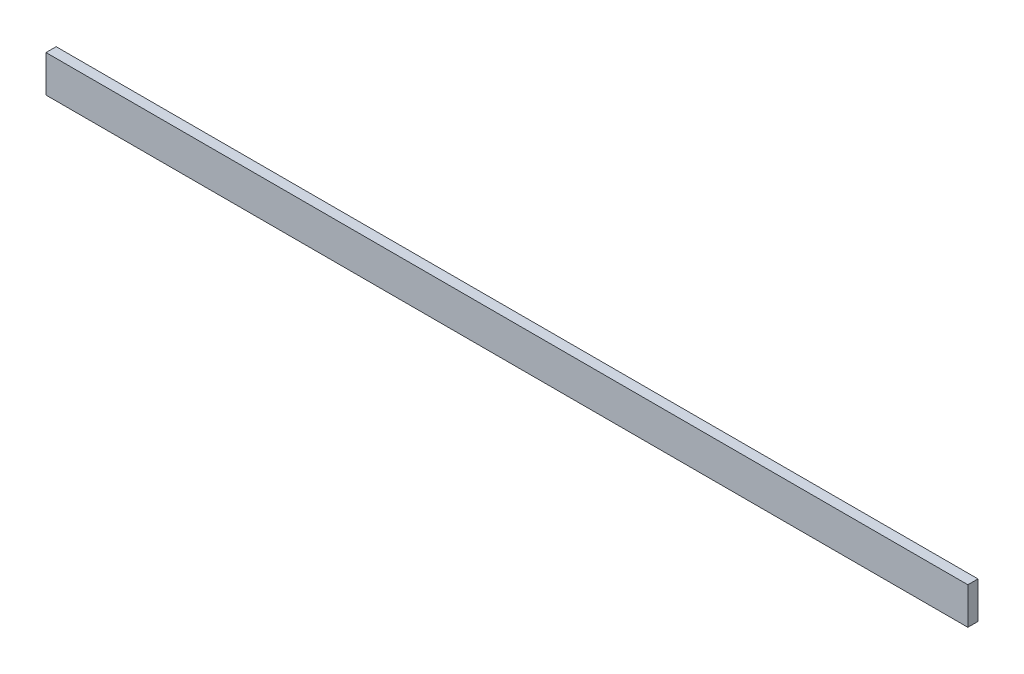
ISO-10303-21;
HEADER;
FILE_DESCRIPTION(('STEP AP214'),'2;1');
FILE_NAME('part.step','',(''),(''),'','','');
FILE_SCHEMA(('AUTOMOTIVE_DESIGN { 1 0 10303 214 1 1 1 1 }'));
ENDSEC;
DATA;
#1=APPLICATION_CONTEXT('core data for automotive mechanical design processes');
#2=APPLICATION_PROTOCOL_DEFINITION('international standard','automotive_design',2000,#1);
#3=PRODUCT_CONTEXT('',#1,'mechanical');
#4=PRODUCT('Part','Part','',(#3));
#5=PRODUCT_RELATED_PRODUCT_CATEGORY('part','',(#4));
#6=PRODUCT_DEFINITION_FORMATION('','',#4);
#7=PRODUCT_DEFINITION_CONTEXT('part definition',#1,'design');
#8=PRODUCT_DEFINITION('design','',#6,#7);
#9=PRODUCT_DEFINITION_SHAPE('','',#8);
#10=(LENGTH_UNIT() NAMED_UNIT(*) SI_UNIT(.MILLI.,.METRE.));
#11=(NAMED_UNIT(*) PLANE_ANGLE_UNIT() SI_UNIT($,.RADIAN.));
#12=(NAMED_UNIT(*) SI_UNIT($,.STERADIAN.) SOLID_ANGLE_UNIT());
#13=UNCERTAINTY_MEASURE_WITH_UNIT(LENGTH_MEASURE(1.E-05),#10,'distance_accuracy_value','');
#14=(GEOMETRIC_REPRESENTATION_CONTEXT(3) GLOBAL_UNCERTAINTY_ASSIGNED_CONTEXT((#13)) GLOBAL_UNIT_ASSIGNED_CONTEXT((#10,
#11,#12)) REPRESENTATION_CONTEXT('',''));
#15=CARTESIAN_POINT('',(0.,0.,0.));
#16=DIRECTION('',(0.,0.,1.));
#17=DIRECTION('',(1.,0.,0.));
#18=AXIS2_PLACEMENT_3D('',#15,#16,#17);
#19=CARTESIAN_POINT('',(0.,0.,22.));
#20=DIRECTION('',(1.,0.,0.));
#21=DIRECTION('',(0.,0.,-1.));
#22=AXIS2_PLACEMENT_3D('',#19,#20,#21);
#23=PLANE('',#22);
#24=DIRECTION('',(0.,-1.,0.));
#25=VECTOR('',#24,1.);
#26=CARTESIAN_POINT('',(0.,0.,0.));
#27=LINE('',#26,#25);
#28=CARTESIAN_POINT('',(0.,80.,0.));
#29=VERTEX_POINT('',#28);
#30=CARTESIAN_POINT('',(0.,0.,0.));
#31=VERTEX_POINT('',#30);
#32=EDGE_CURVE('E94',#29,#31,#27,.T.);
#33=ORIENTED_EDGE('',*,*,#32,.T.);
#34=DIRECTION('',(0.,0.,-1.));
#35=VECTOR('',#34,1.);
#36=CARTESIAN_POINT('',(0.,0.,22.));
#37=LINE('',#36,#35);
#38=CARTESIAN_POINT('',(0.,0.,22.));
#39=VERTEX_POINT('',#38);
#40=EDGE_CURVE('E11',#39,#31,#37,.T.);
#41=ORIENTED_EDGE('',*,*,#40,.F.);
#42=DIRECTION('',(0.,-1.,0.));
#43=VECTOR('',#42,1.);
#44=CARTESIAN_POINT('',(0.,0.,22.));
#45=LINE('',#44,#43);
#46=CARTESIAN_POINT('',(0.,80.,22.));
#47=VERTEX_POINT('',#46);
#48=EDGE_CURVE('E82',#47,#39,#45,.T.);
#49=ORIENTED_EDGE('',*,*,#48,.F.);
#50=DIRECTION('',(0.,0.,-1.));
#51=VECTOR('',#50,1.);
#52=CARTESIAN_POINT('',(0.,80.,22.));
#53=LINE('',#52,#51);
#54=EDGE_CURVE('E90',#47,#29,#53,.T.);
#55=ORIENTED_EDGE('',*,*,#54,.T.);
#56=EDGE_LOOP('',(#33,#41,#49,#55));
#57=FACE_BOUND('',#56,.T.);
#58=ADVANCED_FACE('F31',(#57),#23,.F.);
#59=CARTESIAN_POINT('',(0.,0.,22.));
#60=DIRECTION('',(0.,1.,0.));
#61=DIRECTION('',(0.,0.,1.));
#62=AXIS2_PLACEMENT_3D('',#59,#60,#61);
#63=PLANE('',#62);
#64=DIRECTION('',(1.,0.,0.));
#65=VECTOR('',#64,1.);
#66=CARTESIAN_POINT('',(0.,0.,0.));
#67=LINE('',#66,#65);
#68=CARTESIAN_POINT('',(2000.,0.,0.));
#69=VERTEX_POINT('',#68);
#70=EDGE_CURVE('E86',#31,#69,#67,.T.);
#71=ORIENTED_EDGE('',*,*,#70,.T.);
#72=DIRECTION('',(0.,0.,-1.));
#73=VECTOR('',#72,1.);
#74=CARTESIAN_POINT('',(2000.,0.,22.));
#75=LINE('',#74,#73);
#76=CARTESIAN_POINT('',(2000.,0.,22.));
#77=VERTEX_POINT('',#76);
#78=EDGE_CURVE('E39',#77,#69,#75,.T.);
#79=ORIENTED_EDGE('',*,*,#78,.F.);
#80=DIRECTION('',(1.,0.,0.));
#81=VECTOR('',#80,1.);
#82=CARTESIAN_POINT('',(0.,0.,22.));
#83=LINE('',#82,#81);
#84=EDGE_CURVE('E77',#39,#77,#83,.T.);
#85=ORIENTED_EDGE('',*,*,#84,.F.);
#86=ORIENTED_EDGE('',*,*,#40,.T.);
#87=EDGE_LOOP('',(#71,#79,#85,#86));
#88=FACE_BOUND('',#87,.T.);
#89=ADVANCED_FACE('F85',(#88),#63,.F.);
#90=CARTESIAN_POINT('',(2000.,0.,22.));
#91=DIRECTION('',(-1.,0.,0.));
#92=DIRECTION('',(0.,0.,1.));
#93=AXIS2_PLACEMENT_3D('',#90,#91,#92);
#94=PLANE('',#93);
#95=DIRECTION('',(0.,1.,0.));
#96=VECTOR('',#95,1.);
#97=CARTESIAN_POINT('',(2000.,0.,0.));
#98=LINE('',#97,#96);
#99=CARTESIAN_POINT('',(2000.,80.,0.));
#100=VERTEX_POINT('',#99);
#101=EDGE_CURVE('E64',#69,#100,#98,.T.);
#102=ORIENTED_EDGE('',*,*,#101,.T.);
#103=DIRECTION('',(0.,0.,-1.));
#104=VECTOR('',#103,1.);
#105=CARTESIAN_POINT('',(2000.,80.,22.));
#106=LINE('',#105,#104);
#107=CARTESIAN_POINT('',(2000.,80.,22.));
#108=VERTEX_POINT('',#107);
#109=EDGE_CURVE('E87',#108,#100,#106,.T.);
#110=ORIENTED_EDGE('',*,*,#109,.F.);
#111=DIRECTION('',(0.,1.,0.));
#112=VECTOR('',#111,1.);
#113=CARTESIAN_POINT('',(2000.,0.,22.));
#114=LINE('',#113,#112);
#115=EDGE_CURVE('E80',#77,#108,#114,.T.);
#116=ORIENTED_EDGE('',*,*,#115,.F.);
#117=ORIENTED_EDGE('',*,*,#78,.T.);
#118=EDGE_LOOP('',(#102,#110,#116,#117));
#119=FACE_BOUND('',#118,.T.);
#120=ADVANCED_FACE('F88',(#119),#94,.F.);
#121=CARTESIAN_POINT('',(0.,80.,22.));
#122=DIRECTION('',(0.,-1.,0.));
#123=DIRECTION('',(0.,0.,-1.));
#124=AXIS2_PLACEMENT_3D('',#121,#122,#123);
#125=PLANE('',#124);
#126=DIRECTION('',(-1.,0.,0.));
#127=VECTOR('',#126,1.);
#128=CARTESIAN_POINT('',(0.,80.,0.));
#129=LINE('',#128,#127);
#130=EDGE_CURVE('E70',#100,#29,#129,.T.);
#131=ORIENTED_EDGE('',*,*,#130,.T.);
#132=ORIENTED_EDGE('',*,*,#54,.F.);
#133=DIRECTION('',(-1.,0.,0.));
#134=VECTOR('',#133,1.);
#135=CARTESIAN_POINT('',(0.,80.,22.));
#136=LINE('',#135,#134);
#137=EDGE_CURVE('E47',#108,#47,#136,.T.);
#138=ORIENTED_EDGE('',*,*,#137,.F.);
#139=ORIENTED_EDGE('',*,*,#109,.T.);
#140=EDGE_LOOP('',(#131,#132,#138,#139));
#141=FACE_BOUND('',#140,.T.);
#142=ADVANCED_FACE('F101',(#141),#125,.F.);
#143=CARTESIAN_POINT('',(0.,80.,22.));
#144=DIRECTION('',(0.,0.,-1.));
#145=DIRECTION('',(-1.,0.,0.));
#146=AXIS2_PLACEMENT_3D('',#143,#144,#145);
#147=PLANE('',#146);
#148=ORIENTED_EDGE('',*,*,#48,.T.);
#149=ORIENTED_EDGE('',*,*,#84,.T.);
#150=ORIENTED_EDGE('',*,*,#115,.T.);
#151=ORIENTED_EDGE('',*,*,#137,.T.);
#152=EDGE_LOOP('',(#148,#149,#150,#151));
#153=FACE_BOUND('',#152,.T.);
#154=ADVANCED_FACE('F78',(#153),#147,.F.);
#155=CARTESIAN_POINT('',(0.,80.,0.));
#156=DIRECTION('',(0.,0.,-1.));
#157=DIRECTION('',(-1.,0.,0.));
#158=AXIS2_PLACEMENT_3D('',#155,#156,#157);
#159=PLANE('',#158);
#160=ORIENTED_EDGE('',*,*,#32,.F.);
#161=ORIENTED_EDGE('',*,*,#130,.F.);
#162=ORIENTED_EDGE('',*,*,#101,.F.);
#163=ORIENTED_EDGE('',*,*,#70,.F.);
#164=EDGE_LOOP('',(#160,#161,#162,#163));
#165=FACE_BOUND('',#164,.T.);
#166=ADVANCED_FACE('F104',(#165),#159,.T.);
#167=CLOSED_SHELL('',(#58,#89,#120,#142,#154,#166));
#168=MANIFOLD_SOLID_BREP('B2',#167);
#169=ADVANCED_BREP_SHAPE_REPRESENTATION('',(#18,#168),#14);
#170=SHAPE_DEFINITION_REPRESENTATION(#9,#169);
ENDSEC;
END-ISO-10303-21;
